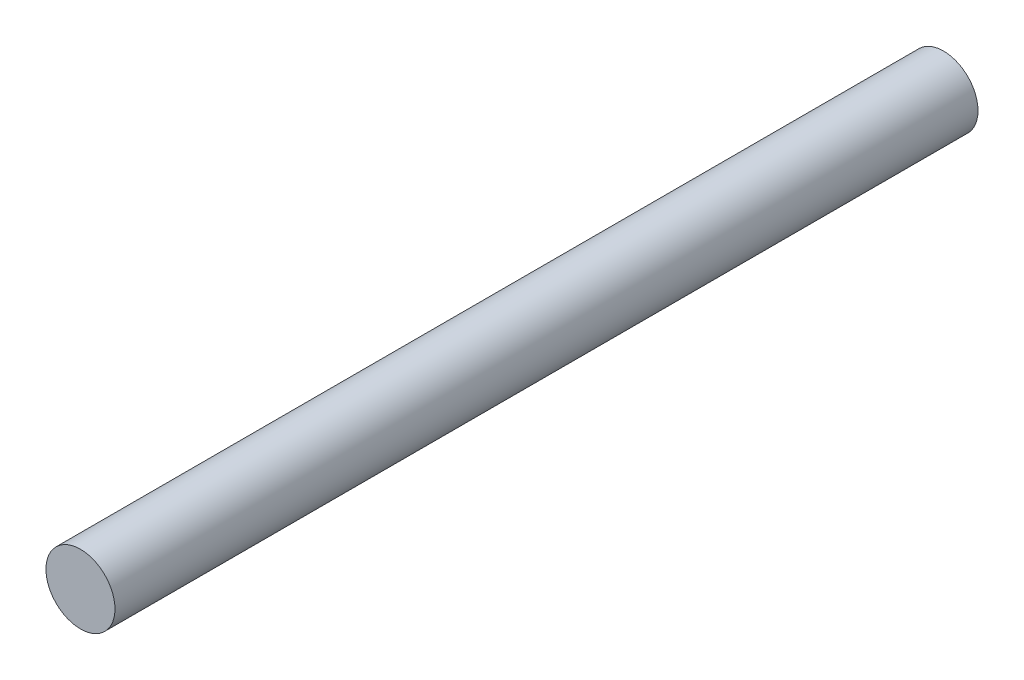
ISO-10303-21;
HEADER;
FILE_DESCRIPTION(('STEP AP214'),'2;1');
FILE_NAME('part.step','',(''),(''),'','','');
FILE_SCHEMA(('AUTOMOTIVE_DESIGN { 1 0 10303 214 1 1 1 1 }'));
ENDSEC;
DATA;
#1=APPLICATION_CONTEXT('core data for automotive mechanical design processes');
#2=APPLICATION_PROTOCOL_DEFINITION('international standard','automotive_design',2000,#1);
#3=PRODUCT_CONTEXT('',#1,'mechanical');
#4=PRODUCT('Part','Part','',(#3));
#5=PRODUCT_RELATED_PRODUCT_CATEGORY('part','',(#4));
#6=PRODUCT_DEFINITION_FORMATION('','',#4);
#7=PRODUCT_DEFINITION_CONTEXT('part definition',#1,'design');
#8=PRODUCT_DEFINITION('design','',#6,#7);
#9=PRODUCT_DEFINITION_SHAPE('','',#8);
#10=(LENGTH_UNIT() NAMED_UNIT(*) SI_UNIT(.MILLI.,.METRE.));
#11=(NAMED_UNIT(*) PLANE_ANGLE_UNIT() SI_UNIT($,.RADIAN.));
#12=(NAMED_UNIT(*) SI_UNIT($,.STERADIAN.) SOLID_ANGLE_UNIT());
#13=UNCERTAINTY_MEASURE_WITH_UNIT(LENGTH_MEASURE(1.E-05),#10,'distance_accuracy_value','');
#14=(GEOMETRIC_REPRESENTATION_CONTEXT(3) GLOBAL_UNCERTAINTY_ASSIGNED_CONTEXT((#13)) GLOBAL_UNIT_ASSIGNED_CONTEXT((#10,
#11,#12)) REPRESENTATION_CONTEXT('',''));
#15=CARTESIAN_POINT('',(0.,0.,0.));
#16=DIRECTION('',(0.,0.,1.));
#17=DIRECTION('',(1.,0.,0.));
#18=AXIS2_PLACEMENT_3D('',#15,#16,#17);
#19=CARTESIAN_POINT('',(0.,0.,100.));
#20=DIRECTION('',(0.,0.,-1.));
#21=DIRECTION('',(-1.,0.,0.));
#22=AXIS2_PLACEMENT_3D('',#19,#20,#21);
#23=CYLINDRICAL_SURFACE('',#22,4.);
#24=CARTESIAN_POINT('',(0.,0.,100.));
#25=DIRECTION('',(0.,0.,1.));
#26=DIRECTION('',(1.,0.,0.));
#27=AXIS2_PLACEMENT_3D('',#24,#25,#26);
#28=CIRCLE('',#27,4.);
#29=CARTESIAN_POINT('',(4.,0.,100.));
#30=VERTEX_POINT('',#29);
#31=EDGE_CURVE('E10',#30,#30,#28,.T.);
#32=ORIENTED_EDGE('',*,*,#31,.F.);
#33=EDGE_LOOP('',(#32));
#34=FACE_BOUND('',#33,.T.);
#35=CARTESIAN_POINT('',(0.,0.,0.));
#36=DIRECTION('',(0.,0.,1.));
#37=DIRECTION('',(1.,0.,0.));
#38=AXIS2_PLACEMENT_3D('',#35,#36,#37);
#39=CIRCLE('',#38,4.);
#40=CARTESIAN_POINT('',(4.,0.,0.));
#41=VERTEX_POINT('',#40);
#42=EDGE_CURVE('E38',#41,#41,#39,.T.);
#43=ORIENTED_EDGE('',*,*,#42,.T.);
#44=EDGE_LOOP('',(#43));
#45=FACE_BOUND('',#44,.T.);
#46=ADVANCED_FACE('F35',(#34,#45),#23,.T.);
#47=CARTESIAN_POINT('',(0.,0.,100.));
#48=DIRECTION('',(0.,0.,1.));
#49=DIRECTION('',(1.,0.,0.));
#50=AXIS2_PLACEMENT_3D('',#47,#48,#49);
#51=PLANE('',#50);
#52=ORIENTED_EDGE('',*,*,#31,.T.);
#53=EDGE_LOOP('',(#52));
#54=FACE_BOUND('',#53,.T.);
#55=ADVANCED_FACE('F50',(#54),#51,.T.);
#56=CARTESIAN_POINT('',(0.,0.,0.));
#57=DIRECTION('',(0.,0.,1.));
#58=DIRECTION('',(1.,0.,0.));
#59=AXIS2_PLACEMENT_3D('',#56,#57,#58);
#60=PLANE('',#59);
#61=ORIENTED_EDGE('',*,*,#42,.F.);
#62=EDGE_LOOP('',(#61));
#63=FACE_BOUND('',#62,.T.);
#64=ADVANCED_FACE('F48',(#63),#60,.F.);
#65=CLOSED_SHELL('',(#46,#55,#64));
#66=MANIFOLD_SOLID_BREP('B2',#65);
#67=ADVANCED_BREP_SHAPE_REPRESENTATION('',(#18,#66),#14);
#68=SHAPE_DEFINITION_REPRESENTATION(#9,#67);
ENDSEC;
END-ISO-10303-21;
